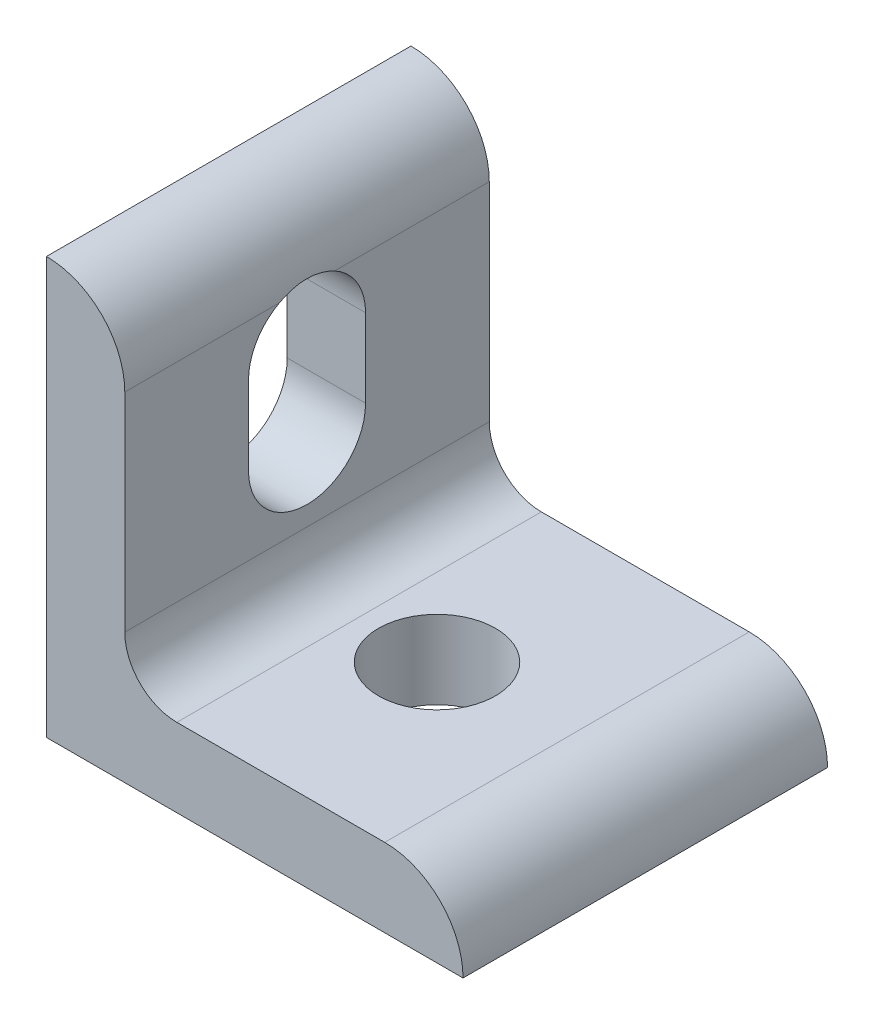
ISO-10303-21;
HEADER;
FILE_DESCRIPTION(('STEP AP214'),'2;1');
FILE_NAME('part.step','',(''),(''),'','','');
FILE_SCHEMA(('AUTOMOTIVE_DESIGN { 1 0 10303 214 1 1 1 1 }'));
ENDSEC;
DATA;
#1=APPLICATION_CONTEXT('core data for automotive mechanical design processes');
#2=APPLICATION_PROTOCOL_DEFINITION('international standard','automotive_design',2000,#1);
#3=PRODUCT_CONTEXT('',#1,'mechanical');
#4=PRODUCT('Part','Part','',(#3));
#5=PRODUCT_RELATED_PRODUCT_CATEGORY('part','',(#4));
#6=PRODUCT_DEFINITION_FORMATION('','',#4);
#7=PRODUCT_DEFINITION_CONTEXT('part definition',#1,'design');
#8=PRODUCT_DEFINITION('design','',#6,#7);
#9=PRODUCT_DEFINITION_SHAPE('','',#8);
#10=(LENGTH_UNIT() NAMED_UNIT(*) SI_UNIT(.MILLI.,.METRE.));
#11=(NAMED_UNIT(*) PLANE_ANGLE_UNIT() SI_UNIT($,.RADIAN.));
#12=(NAMED_UNIT(*) SI_UNIT($,.STERADIAN.) SOLID_ANGLE_UNIT());
#13=UNCERTAINTY_MEASURE_WITH_UNIT(LENGTH_MEASURE(1.E-05),#10,'distance_accuracy_value','');
#14=(GEOMETRIC_REPRESENTATION_CONTEXT(3) GLOBAL_UNCERTAINTY_ASSIGNED_CONTEXT((#13)) GLOBAL_UNIT_ASSIGNED_CONTEXT((#10,
#11,#12)) REPRESENTATION_CONTEXT('',''));
#15=CARTESIAN_POINT('',(0.,0.,0.));
#16=DIRECTION('',(0.,0.,1.));
#17=DIRECTION('',(1.,0.,0.));
#18=AXIS2_PLACEMENT_3D('',#15,#16,#17);
#19=CARTESIAN_POINT('',(-12.7,7.9248,-11.1125));
#20=DIRECTION('',(0.,0.,1.));
#21=DIRECTION('',(1.,0.,0.));
#22=AXIS2_PLACEMENT_3D('',#19,#20,#21);
#23=CYLINDRICAL_SURFACE('',#22,4.7752);
#24=CARTESIAN_POINT('',(-7.9248,7.9248,-1.67798674905376));
#25=CARTESIAN_POINT('',(-7.92481560049592,7.97198264026627,-1.58944695004193));
#26=CARTESIAN_POINT('',(-7.92550012205361,8.01540977478818,-1.49891433040589));
#27=CARTESIAN_POINT('',(-7.92764776843833,8.0944880787926,-1.31452958616631));
#28=CARTESIAN_POINT('',(-7.929110840339,8.13013977662215,-1.22067768761434));
#29=CARTESIAN_POINT('',(-7.93225439032208,8.19336625267331,-1.03043614312271));
#30=CARTESIAN_POINT('',(-7.93393457377953,8.22095181424074,-0.934050074774575));
#31=CARTESIAN_POINT('',(-7.93708478391002,8.26791971032118,-0.739297367598972));
#32=CARTESIAN_POINT('',(-7.93855481380049,8.28730217043143,-0.6409307591196));
#33=CARTESIAN_POINT('',(-7.94096961658513,8.31773484760735,-0.442847496805783));
#34=CARTESIAN_POINT('',(-7.94191406229188,8.32877987596424,-0.343130041511914));
#35=CARTESIAN_POINT('',(-7.94309359017064,8.3424409536407,-0.143068965573384));
#36=CARTESIAN_POINT('',(-7.94332834804512,8.34505314954708,-0.0427250796564538));
#37=CARTESIAN_POINT('',(-7.94304377497829,8.341819075309,0.157803071244914));
#38=CARTESIAN_POINT('',(-7.94252460460013,8.33597460617069,0.257987365668804));
#39=CARTESIAN_POINT('',(-7.94083039182643,8.31587724756712,0.457456784566718));
#40=CARTESIAN_POINT('',(-7.93965566575332,8.30162841323472,0.556742319252861));
#41=CARTESIAN_POINT('',(-7.93701861799582,8.26658902460885,0.744337426092724));
#42=CARTESIAN_POINT('',(-7.93559448865452,8.24655339572945,0.832789488293525));
#43=CARTESIAN_POINT('',(-7.9326683654564,8.19981049650334,1.00790623806296));
#44=CARTESIAN_POINT('',(-7.93116637764446,8.17310374348454,1.09457106366315));
#45=CARTESIAN_POINT('',(-7.92842086118506,8.11314773705982,1.26567968386014));
#46=CARTESIAN_POINT('',(-7.92717751363214,8.07989393104252,1.35012188632909));
#47=CARTESIAN_POINT('',(-7.9253721376969,8.00704969992215,1.51624796495461));
#48=CARTESIAN_POINT('',(-7.92481020248326,7.96745840914012,1.59793146243284));
#49=CARTESIAN_POINT('',(-7.9248,7.9248,1.67798674905376));
#50=B_SPLINE_CURVE_WITH_KNOTS('',3,(#24,#25,#26,#27,#28,#29,#30,#31,#32,#33,#34,#35,#36,#37,#38,
#39,#40,#41,#42,#43,#44,#45,#46,#47,#48,#49),.UNSPECIFIED.,.F.,.F.,(4,2,2,2,2,2,2,2,2,2,2,2,4),
(0.,0.300879588223929,0.60173872506888,0.902193795053617,1.20264426462115,1.50328156242041,
1.80405621808538,2.1047668275479,2.40533246174311,2.67718634841712,2.94901916008736,
3.22104166750748,3.4931013640392),.UNSPECIFIED.);
#51=CARTESIAN_POINT('',(-7.9248,7.9248,-1.67798674905376));
#52=VERTEX_POINT('',#51);
#53=CARTESIAN_POINT('',(-7.9248,7.9248,1.67798674905376));
#54=VERTEX_POINT('',#53);
#55=EDGE_CURVE('E164',#52,#54,#50,.T.);
#56=ORIENTED_EDGE('',*,*,#55,.F.);
#57=DIRECTION('',(0.,0.,1.));
#58=VECTOR('',#57,1.);
#59=CARTESIAN_POINT('',(-7.9248,7.9248,-11.1125));
#60=LINE('',#59,#58);
#61=CARTESIAN_POINT('',(-7.9248,7.9248,-11.1125));
#62=VERTEX_POINT('',#61);
#63=EDGE_CURVE('E11',#62,#52,#60,.T.);
#64=ORIENTED_EDGE('',*,*,#63,.F.);
#65=CARTESIAN_POINT('',(-12.7,7.9248,-11.1125));
#66=DIRECTION('',(0.,0.,1.));
#67=DIRECTION('',(1.,0.,0.));
#68=AXIS2_PLACEMENT_3D('',#65,#66,#67);
#69=CIRCLE('',#68,4.7752);
#70=CARTESIAN_POINT('',(-12.7,12.7,-11.1125));
#71=VERTEX_POINT('',#70);
#72=EDGE_CURVE('E269',#62,#71,#69,.T.);
#73=ORIENTED_EDGE('',*,*,#72,.T.);
#74=DIRECTION('',(0.,0.,1.));
#75=VECTOR('',#74,1.);
#76=CARTESIAN_POINT('',(-12.7,12.7,-11.1125));
#77=LINE('',#76,#75);
#78=CARTESIAN_POINT('',(-12.7,12.7,11.1125));
#79=VERTEX_POINT('',#78);
#80=EDGE_CURVE('E36',#71,#79,#77,.T.);
#81=ORIENTED_EDGE('',*,*,#80,.T.);
#82=CARTESIAN_POINT('',(-12.7,7.9248,11.1125));
#83=DIRECTION('',(0.,0.,1.));
#84=DIRECTION('',(1.,0.,0.));
#85=AXIS2_PLACEMENT_3D('',#82,#83,#84);
#86=CIRCLE('',#85,4.7752);
#87=CARTESIAN_POINT('',(-7.9248,7.9248,11.1125));
#88=VERTEX_POINT('',#87);
#89=EDGE_CURVE('E172',#88,#79,#86,.T.);
#90=ORIENTED_EDGE('',*,*,#89,.F.);
#91=EDGE_CURVE('E41',#54,#88,#60,.T.);
#92=ORIENTED_EDGE('',*,*,#91,.F.);
#93=EDGE_LOOP('',(#56,#64,#73,#81,#90,#92));
#94=FACE_BOUND('',#93,.T.);
#95=ADVANCED_FACE('F32',(#94),#23,.T.);
#96=CARTESIAN_POINT('',(-7.9248,-4.7498,-11.1125));
#97=DIRECTION('',(1.,0.,0.));
#98=DIRECTION('',(0.,0.,-1.));
#99=AXIS2_PLACEMENT_3D('',#96,#97,#98);
#100=PLANE('',#99);
#101=CARTESIAN_POINT('',(-7.9248,4.7752,0.));
#102=DIRECTION('',(1.,0.,0.));
#103=DIRECTION('',(0.,0.,-1.));
#104=AXIS2_PLACEMENT_3D('',#101,#102,#103);
#105=CIRCLE('',#104,3.5687);
#106=CARTESIAN_POINT('',(-7.9248,4.7752,-3.5687));
#107=VERTEX_POINT('',#106);
#108=EDGE_CURVE('E165',#107,#52,#105,.T.);
#109=ORIENTED_EDGE('',*,*,#108,.F.);
#110=DIRECTION('',(0.,1.,0.));
#111=VECTOR('',#110,1.);
#112=CARTESIAN_POINT('',(-7.9248,-4.7498,-3.5687));
#113=LINE('',#112,#111);
#114=CARTESIAN_POINT('',(-7.9248,0.,-3.5687));
#115=VERTEX_POINT('',#114);
#116=EDGE_CURVE('E161',#115,#107,#113,.T.);
#117=ORIENTED_EDGE('',*,*,#116,.F.);
#118=CARTESIAN_POINT('',(-7.9248,0.,0.));
#119=DIRECTION('',(1.,0.,0.));
#120=DIRECTION('',(0.,0.,-1.));
#121=AXIS2_PLACEMENT_3D('',#118,#119,#120);
#122=CIRCLE('',#121,3.5687);
#123=CARTESIAN_POINT('',(-7.9248,0.,3.5687));
#124=VERTEX_POINT('',#123);
#125=EDGE_CURVE('E159',#124,#115,#122,.T.);
#126=ORIENTED_EDGE('',*,*,#125,.F.);
#127=DIRECTION('',(0.,-1.,0.));
#128=VECTOR('',#127,1.);
#129=CARTESIAN_POINT('',(-7.9248,-4.7498,3.5687));
#130=LINE('',#129,#128);
#131=CARTESIAN_POINT('',(-7.9248,4.7752,3.5687));
#132=VERTEX_POINT('',#131);
#133=EDGE_CURVE('E153',#132,#124,#130,.T.);
#134=ORIENTED_EDGE('',*,*,#133,.F.);
#135=EDGE_CURVE('E129',#54,#132,#105,.T.);
#136=ORIENTED_EDGE('',*,*,#135,.F.);
#137=ORIENTED_EDGE('',*,*,#91,.T.);
#138=DIRECTION('',(0.,1.,0.));
#139=VECTOR('',#138,1.);
#140=CARTESIAN_POINT('',(-7.9248,-4.7498,11.1125));
#141=LINE('',#140,#139);
#142=CARTESIAN_POINT('',(-7.9248,-4.7498,11.1125));
#143=VERTEX_POINT('',#142);
#144=EDGE_CURVE('E267',#143,#88,#141,.T.);
#145=ORIENTED_EDGE('',*,*,#144,.F.);
#146=DIRECTION('',(0.,0.,1.));
#147=VECTOR('',#146,1.);
#148=CARTESIAN_POINT('',(-7.9248,-4.7498,-11.1125));
#149=LINE('',#148,#147);
#150=CARTESIAN_POINT('',(-7.9248,-4.7498,-11.1125));
#151=VERTEX_POINT('',#150);
#152=EDGE_CURVE('E225',#151,#143,#149,.T.);
#153=ORIENTED_EDGE('',*,*,#152,.F.);
#154=DIRECTION('',(0.,1.,0.));
#155=VECTOR('',#154,1.);
#156=CARTESIAN_POINT('',(-7.9248,-4.7498,-11.1125));
#157=LINE('',#156,#155);
#158=EDGE_CURVE('E223',#151,#62,#157,.T.);
#159=ORIENTED_EDGE('',*,*,#158,.T.);
#160=ORIENTED_EDGE('',*,*,#63,.T.);
#161=EDGE_LOOP('',(#109,#117,#126,#134,#136,#137,#145,#153,#159,#160));
#162=FACE_BOUND('',#161,.T.);
#163=ADVANCED_FACE('F188',(#162),#100,.T.);
#164=CARTESIAN_POINT('',(-4.7498,-4.7498,-11.1125));
#165=DIRECTION('',(0.,0.,1.));
#166=DIRECTION('',(1.,0.,0.));
#167=AXIS2_PLACEMENT_3D('',#164,#165,#166);
#168=CYLINDRICAL_SURFACE('',#167,3.175);
#169=ORIENTED_EDGE('',*,*,#152,.T.);
#170=CARTESIAN_POINT('',(-4.7498,-4.7498,11.1125));
#171=DIRECTION('',(0.,0.,-1.));
#172=DIRECTION('',(-1.,0.,0.));
#173=AXIS2_PLACEMENT_3D('',#170,#171,#172);
#174=CIRCLE('',#173,3.175);
#175=CARTESIAN_POINT('',(-4.7498,-7.9248,11.1125));
#176=VERTEX_POINT('',#175);
#177=EDGE_CURVE('E264',#176,#143,#174,.T.);
#178=ORIENTED_EDGE('',*,*,#177,.F.);
#179=DIRECTION('',(0.,0.,1.));
#180=VECTOR('',#179,1.);
#181=CARTESIAN_POINT('',(-4.7498,-7.9248,-11.1125));
#182=LINE('',#181,#180);
#183=CARTESIAN_POINT('',(-4.7498,-7.9248,-11.1125));
#184=VERTEX_POINT('',#183);
#185=EDGE_CURVE('E236',#184,#176,#182,.T.);
#186=ORIENTED_EDGE('',*,*,#185,.F.);
#187=CARTESIAN_POINT('',(-4.7498,-4.7498,-11.1125));
#188=DIRECTION('',(0.,0.,-1.));
#189=DIRECTION('',(-1.,0.,0.));
#190=AXIS2_PLACEMENT_3D('',#187,#188,#189);
#191=CIRCLE('',#190,3.175);
#192=EDGE_CURVE('E228',#184,#151,#191,.T.);
#193=ORIENTED_EDGE('',*,*,#192,.T.);
#194=EDGE_LOOP('',(#169,#178,#186,#193));
#195=FACE_BOUND('',#194,.T.);
#196=ADVANCED_FACE('F191',(#195),#168,.F.);
#197=CARTESIAN_POINT('',(7.9248,-7.9248,-11.1125));
#198=DIRECTION('',(0.,1.,0.));
#199=DIRECTION('',(-1.,0.,0.));
#200=AXIS2_PLACEMENT_3D('',#197,#198,#199);
#201=PLANE('',#200);
#202=CARTESIAN_POINT('',(0.,-7.9248,0.));
#203=DIRECTION('',(0.,1.,0.));
#204=DIRECTION('',(-1.,0.,0.));
#205=AXIS2_PLACEMENT_3D('',#202,#203,#204);
#206=CIRCLE('',#205,3.5687);
#207=CARTESIAN_POINT('',(-3.5687,-7.9248,0.));
#208=VERTEX_POINT('',#207);
#209=EDGE_CURVE('E145',#208,#208,#206,.T.);
#210=ORIENTED_EDGE('',*,*,#209,.F.);
#211=EDGE_LOOP('',(#210));
#212=FACE_BOUND('',#211,.T.);
#213=ORIENTED_EDGE('',*,*,#185,.T.);
#214=DIRECTION('',(-1.,0.,0.));
#215=VECTOR('',#214,1.);
#216=CARTESIAN_POINT('',(7.9248,-7.9248,11.1125));
#217=LINE('',#216,#215);
#218=CARTESIAN_POINT('',(7.9248,-7.9248,11.1125));
#219=VERTEX_POINT('',#218);
#220=EDGE_CURVE('E259',#219,#176,#217,.T.);
#221=ORIENTED_EDGE('',*,*,#220,.F.);
#222=DIRECTION('',(0.,0.,1.));
#223=VECTOR('',#222,1.);
#224=CARTESIAN_POINT('',(7.9248,-7.9248,-11.1125));
#225=LINE('',#224,#223);
#226=CARTESIAN_POINT('',(7.9248,-7.9248,-11.1125));
#227=VERTEX_POINT('',#226);
#228=EDGE_CURVE('E238',#227,#219,#225,.T.);
#229=ORIENTED_EDGE('',*,*,#228,.F.);
#230=DIRECTION('',(-1.,0.,0.));
#231=VECTOR('',#230,1.);
#232=CARTESIAN_POINT('',(7.9248,-7.9248,-11.1125));
#233=LINE('',#232,#231);
#234=EDGE_CURVE('E231',#227,#184,#233,.T.);
#235=ORIENTED_EDGE('',*,*,#234,.T.);
#236=EDGE_LOOP('',(#213,#221,#229,#235));
#237=FACE_BOUND('',#236,.T.);
#238=ADVANCED_FACE('F195',(#212,#237),#201,.T.);
#239=CARTESIAN_POINT('',(7.9248,-12.7,-11.1125));
#240=DIRECTION('',(0.,0.,1.));
#241=DIRECTION('',(1.,0.,0.));
#242=AXIS2_PLACEMENT_3D('',#239,#240,#241);
#243=CYLINDRICAL_SURFACE('',#242,4.7752);
#244=ORIENTED_EDGE('',*,*,#228,.T.);
#245=CARTESIAN_POINT('',(7.9248,-12.7,11.1125));
#246=DIRECTION('',(0.,0.,1.));
#247=DIRECTION('',(-1.,0.,0.));
#248=AXIS2_PLACEMENT_3D('',#245,#246,#247);
#249=CIRCLE('',#248,4.7752);
#250=CARTESIAN_POINT('',(12.7,-12.7,11.1125));
#251=VERTEX_POINT('',#250);
#252=EDGE_CURVE('E257',#251,#219,#249,.T.);
#253=ORIENTED_EDGE('',*,*,#252,.F.);
#254=DIRECTION('',(0.,0.,1.));
#255=VECTOR('',#254,1.);
#256=CARTESIAN_POINT('',(12.7,-12.7,-11.1125));
#257=LINE('',#256,#255);
#258=CARTESIAN_POINT('',(12.7,-12.7,-11.1125));
#259=VERTEX_POINT('',#258);
#260=EDGE_CURVE('E240',#259,#251,#257,.T.);
#261=ORIENTED_EDGE('',*,*,#260,.F.);
#262=CARTESIAN_POINT('',(7.9248,-12.7,-11.1125));
#263=DIRECTION('',(0.,0.,1.));
#264=DIRECTION('',(-1.,0.,0.));
#265=AXIS2_PLACEMENT_3D('',#262,#263,#264);
#266=CIRCLE('',#265,4.7752);
#267=EDGE_CURVE('E274',#259,#227,#266,.T.);
#268=ORIENTED_EDGE('',*,*,#267,.T.);
#269=EDGE_LOOP('',(#244,#253,#261,#268));
#270=FACE_BOUND('',#269,.T.);
#271=ADVANCED_FACE('F199',(#270),#243,.T.);
#272=CARTESIAN_POINT('',(-12.7,-12.7,-11.1125));
#273=DIRECTION('',(0.,-1.,0.));
#274=DIRECTION('',(0.,0.,-1.));
#275=AXIS2_PLACEMENT_3D('',#272,#273,#274);
#276=PLANE('',#275);
#277=CARTESIAN_POINT('',(0.,-12.7,0.));
#278=DIRECTION('',(0.,1.,0.));
#279=DIRECTION('',(-1.,0.,0.));
#280=AXIS2_PLACEMENT_3D('',#277,#278,#279);
#281=CIRCLE('',#280,3.5687);
#282=CARTESIAN_POINT('',(-3.5687,-12.7,0.));
#283=VERTEX_POINT('',#282);
#284=EDGE_CURVE('E142',#283,#283,#281,.T.);
#285=ORIENTED_EDGE('',*,*,#284,.T.);
#286=EDGE_LOOP('',(#285));
#287=FACE_BOUND('',#286,.T.);
#288=ORIENTED_EDGE('',*,*,#260,.T.);
#289=DIRECTION('',(1.,0.,0.));
#290=VECTOR('',#289,1.);
#291=CARTESIAN_POINT('',(-12.7,-12.7,11.1125));
#292=LINE('',#291,#290);
#293=CARTESIAN_POINT('',(-12.7,-12.7,11.1125));
#294=VERTEX_POINT('',#293);
#295=EDGE_CURVE('E254',#294,#251,#292,.T.);
#296=ORIENTED_EDGE('',*,*,#295,.F.);
#297=DIRECTION('',(0.,0.,1.));
#298=VECTOR('',#297,1.);
#299=CARTESIAN_POINT('',(-12.7,-12.7,-11.1125));
#300=LINE('',#299,#298);
#301=CARTESIAN_POINT('',(-12.7,-12.7,-11.1125));
#302=VERTEX_POINT('',#301);
#303=EDGE_CURVE('E230',#302,#294,#300,.T.);
#304=ORIENTED_EDGE('',*,*,#303,.F.);
#305=DIRECTION('',(1.,0.,0.));
#306=VECTOR('',#305,1.);
#307=CARTESIAN_POINT('',(-12.7,-12.7,-11.1125));
#308=LINE('',#307,#306);
#309=EDGE_CURVE('E272',#302,#259,#308,.T.);
#310=ORIENTED_EDGE('',*,*,#309,.T.);
#311=EDGE_LOOP('',(#288,#296,#304,#310));
#312=FACE_BOUND('',#311,.T.);
#313=ADVANCED_FACE('F203',(#287,#312),#276,.T.);
#314=CARTESIAN_POINT('',(-12.7,12.7,-11.1125));
#315=DIRECTION('',(-1.,0.,0.));
#316=DIRECTION('',(0.,0.,1.));
#317=AXIS2_PLACEMENT_3D('',#314,#315,#316);
#318=PLANE('',#317);
#319=CARTESIAN_POINT('',(-12.7,4.7752,0.));
#320=DIRECTION('',(1.,0.,0.));
#321=DIRECTION('',(0.,0.,-1.));
#322=AXIS2_PLACEMENT_3D('',#319,#320,#321);
#323=CIRCLE('',#322,3.5687);
#324=CARTESIAN_POINT('',(-12.7,4.7752,-3.5687));
#325=VERTEX_POINT('',#324);
#326=CARTESIAN_POINT('',(-12.7,4.7752,3.5687));
#327=VERTEX_POINT('',#326);
#328=EDGE_CURVE('E126',#325,#327,#323,.T.);
#329=ORIENTED_EDGE('',*,*,#328,.T.);
#330=DIRECTION('',(0.,-1.,0.));
#331=VECTOR('',#330,1.);
#332=CARTESIAN_POINT('',(-12.7,4.7752,3.5687));
#333=LINE('',#332,#331);
#334=CARTESIAN_POINT('',(-12.7,0.,3.5687));
#335=VERTEX_POINT('',#334);
#336=EDGE_CURVE('E135',#327,#335,#333,.T.);
#337=ORIENTED_EDGE('',*,*,#336,.T.);
#338=CARTESIAN_POINT('',(-12.7,0.,0.));
#339=DIRECTION('',(1.,0.,0.));
#340=DIRECTION('',(0.,0.,-1.));
#341=AXIS2_PLACEMENT_3D('',#338,#339,#340);
#342=CIRCLE('',#341,3.5687);
#343=CARTESIAN_POINT('',(-12.7,0.,-3.5687));
#344=VERTEX_POINT('',#343);
#345=EDGE_CURVE('E57',#335,#344,#342,.T.);
#346=ORIENTED_EDGE('',*,*,#345,.T.);
#347=DIRECTION('',(0.,1.,0.));
#348=VECTOR('',#347,1.);
#349=CARTESIAN_POINT('',(-12.7,4.7752,-3.5687));
#350=LINE('',#349,#348);
#351=EDGE_CURVE('E132',#344,#325,#350,.T.);
#352=ORIENTED_EDGE('',*,*,#351,.T.);
#353=EDGE_LOOP('',(#329,#337,#346,#352));
#354=FACE_BOUND('',#353,.T.);
#355=ORIENTED_EDGE('',*,*,#303,.T.);
#356=DIRECTION('',(0.,-1.,0.));
#357=VECTOR('',#356,1.);
#358=CARTESIAN_POINT('',(-12.7,12.7,11.1125));
#359=LINE('',#358,#357);
#360=EDGE_CURVE('E244',#79,#294,#359,.T.);
#361=ORIENTED_EDGE('',*,*,#360,.F.);
#362=ORIENTED_EDGE('',*,*,#80,.F.);
#363=DIRECTION('',(0.,-1.,0.));
#364=VECTOR('',#363,1.);
#365=CARTESIAN_POINT('',(-12.7,12.7,-11.1125));
#366=LINE('',#365,#364);
#367=EDGE_CURVE('E247',#71,#302,#366,.T.);
#368=ORIENTED_EDGE('',*,*,#367,.T.);
#369=EDGE_LOOP('',(#355,#361,#362,#368));
#370=FACE_BOUND('',#369,.T.);
#371=ADVANCED_FACE('F139',(#354,#370),#318,.T.);
#372=CARTESIAN_POINT('',(-12.7,7.9248,-11.1125));
#373=DIRECTION('',(0.,0.,1.));
#374=DIRECTION('',(1.,0.,0.));
#375=AXIS2_PLACEMENT_3D('',#372,#373,#374);
#376=PLANE('',#375);
#377=ORIENTED_EDGE('',*,*,#72,.F.);
#378=ORIENTED_EDGE('',*,*,#158,.F.);
#379=ORIENTED_EDGE('',*,*,#192,.F.);
#380=ORIENTED_EDGE('',*,*,#234,.F.);
#381=ORIENTED_EDGE('',*,*,#267,.F.);
#382=ORIENTED_EDGE('',*,*,#309,.F.);
#383=ORIENTED_EDGE('',*,*,#367,.F.);
#384=EDGE_LOOP('',(#377,#378,#379,#380,#381,#382,#383));
#385=FACE_BOUND('',#384,.T.);
#386=ADVANCED_FACE('F183',(#385),#376,.F.);
#387=CARTESIAN_POINT('',(-12.7,7.9248,11.1125));
#388=DIRECTION('',(0.,0.,1.));
#389=DIRECTION('',(1.,0.,0.));
#390=AXIS2_PLACEMENT_3D('',#387,#388,#389);
#391=PLANE('',#390);
#392=ORIENTED_EDGE('',*,*,#89,.T.);
#393=ORIENTED_EDGE('',*,*,#360,.T.);
#394=ORIENTED_EDGE('',*,*,#295,.T.);
#395=ORIENTED_EDGE('',*,*,#252,.T.);
#396=ORIENTED_EDGE('',*,*,#220,.T.);
#397=ORIENTED_EDGE('',*,*,#177,.T.);
#398=ORIENTED_EDGE('',*,*,#144,.T.);
#399=EDGE_LOOP('',(#392,#393,#394,#395,#396,#397,#398));
#400=FACE_BOUND('',#399,.T.);
#401=ADVANCED_FACE('F179',(#400),#391,.T.);
#402=CARTESIAN_POINT('',(-12.7,4.7752,0.));
#403=DIRECTION('',(1.,0.,0.));
#404=DIRECTION('',(0.,0.,-1.));
#405=AXIS2_PLACEMENT_3D('',#402,#403,#404);
#406=CYLINDRICAL_SURFACE('',#405,3.5687);
#407=ORIENTED_EDGE('',*,*,#108,.T.);
#408=ORIENTED_EDGE('',*,*,#55,.T.);
#409=ORIENTED_EDGE('',*,*,#135,.T.);
#410=DIRECTION('',(1.,0.,0.));
#411=VECTOR('',#410,1.);
#412=CARTESIAN_POINT('',(-12.7,4.7752,3.5687));
#413=LINE('',#412,#411);
#414=EDGE_CURVE('E49',#327,#132,#413,.T.);
#415=ORIENTED_EDGE('',*,*,#414,.F.);
#416=ORIENTED_EDGE('',*,*,#328,.F.);
#417=DIRECTION('',(1.,0.,0.));
#418=VECTOR('',#417,1.);
#419=CARTESIAN_POINT('',(-12.7,4.7752,-3.5687));
#420=LINE('',#419,#418);
#421=EDGE_CURVE('E151',#325,#107,#420,.T.);
#422=ORIENTED_EDGE('',*,*,#421,.T.);
#423=EDGE_LOOP('',(#407,#408,#409,#415,#416,#422));
#424=FACE_BOUND('',#423,.T.);
#425=ADVANCED_FACE('F123',(#424),#406,.F.);
#426=CARTESIAN_POINT('',(-12.7,4.7752,-3.5687));
#427=DIRECTION('',(0.,0.,-1.));
#428=DIRECTION('',(0.,1.,0.));
#429=AXIS2_PLACEMENT_3D('',#426,#427,#428);
#430=PLANE('',#429);
#431=ORIENTED_EDGE('',*,*,#116,.T.);
#432=ORIENTED_EDGE('',*,*,#421,.F.);
#433=ORIENTED_EDGE('',*,*,#351,.F.);
#434=DIRECTION('',(1.,0.,0.));
#435=VECTOR('',#434,1.);
#436=CARTESIAN_POINT('',(-12.7,0.,-3.5687));
#437=LINE('',#436,#435);
#438=EDGE_CURVE('E154',#344,#115,#437,.T.);
#439=ORIENTED_EDGE('',*,*,#438,.T.);
#440=EDGE_LOOP('',(#431,#432,#433,#439));
#441=FACE_BOUND('',#440,.T.);
#442=ADVANCED_FACE('F178',(#441),#430,.F.);
#443=CARTESIAN_POINT('',(-12.7,0.,0.));
#444=DIRECTION('',(1.,0.,0.));
#445=DIRECTION('',(0.,0.,-1.));
#446=AXIS2_PLACEMENT_3D('',#443,#444,#445);
#447=CYLINDRICAL_SURFACE('',#446,3.5687);
#448=ORIENTED_EDGE('',*,*,#125,.T.);
#449=ORIENTED_EDGE('',*,*,#438,.F.);
#450=ORIENTED_EDGE('',*,*,#345,.F.);
#451=DIRECTION('',(1.,0.,0.));
#452=VECTOR('',#451,1.);
#453=CARTESIAN_POINT('',(-12.7,0.,3.5687));
#454=LINE('',#453,#452);
#455=EDGE_CURVE('E131',#335,#124,#454,.T.);
#456=ORIENTED_EDGE('',*,*,#455,.T.);
#457=EDGE_LOOP('',(#448,#449,#450,#456));
#458=FACE_BOUND('',#457,.T.);
#459=ADVANCED_FACE('F283',(#458),#447,.F.);
#460=CARTESIAN_POINT('',(-12.7,4.7752,3.5687));
#461=DIRECTION('',(0.,0.,1.));
#462=DIRECTION('',(0.,-1.,0.));
#463=AXIS2_PLACEMENT_3D('',#460,#461,#462);
#464=PLANE('',#463);
#465=ORIENTED_EDGE('',*,*,#133,.T.);
#466=ORIENTED_EDGE('',*,*,#455,.F.);
#467=ORIENTED_EDGE('',*,*,#336,.F.);
#468=ORIENTED_EDGE('',*,*,#414,.T.);
#469=EDGE_LOOP('',(#465,#466,#467,#468));
#470=FACE_BOUND('',#469,.T.);
#471=ADVANCED_FACE('F136',(#470),#464,.F.);
#472=CARTESIAN_POINT('',(0.,-12.7,0.));
#473=DIRECTION('',(0.,1.,0.));
#474=DIRECTION('',(-1.,0.,0.));
#475=AXIS2_PLACEMENT_3D('',#472,#473,#474);
#476=CYLINDRICAL_SURFACE('',#475,3.5687);
#477=ORIENTED_EDGE('',*,*,#284,.F.);
#478=EDGE_LOOP('',(#477));
#479=FACE_BOUND('',#478,.T.);
#480=ORIENTED_EDGE('',*,*,#209,.T.);
#481=EDGE_LOOP('',(#480));
#482=FACE_BOUND('',#481,.T.);
#483=ADVANCED_FACE('F291',(#479,#482),#476,.F.);
#484=CLOSED_SHELL('',(#95,#163,#196,#238,#271,#313,#371,#386,#401,#425,#442,#459,#471,#483));
#485=MANIFOLD_SOLID_BREP('B2',#484);
#486=ADVANCED_BREP_SHAPE_REPRESENTATION('',(#18,#485),#14);
#487=SHAPE_DEFINITION_REPRESENTATION(#9,#486);
ENDSEC;
END-ISO-10303-21;
